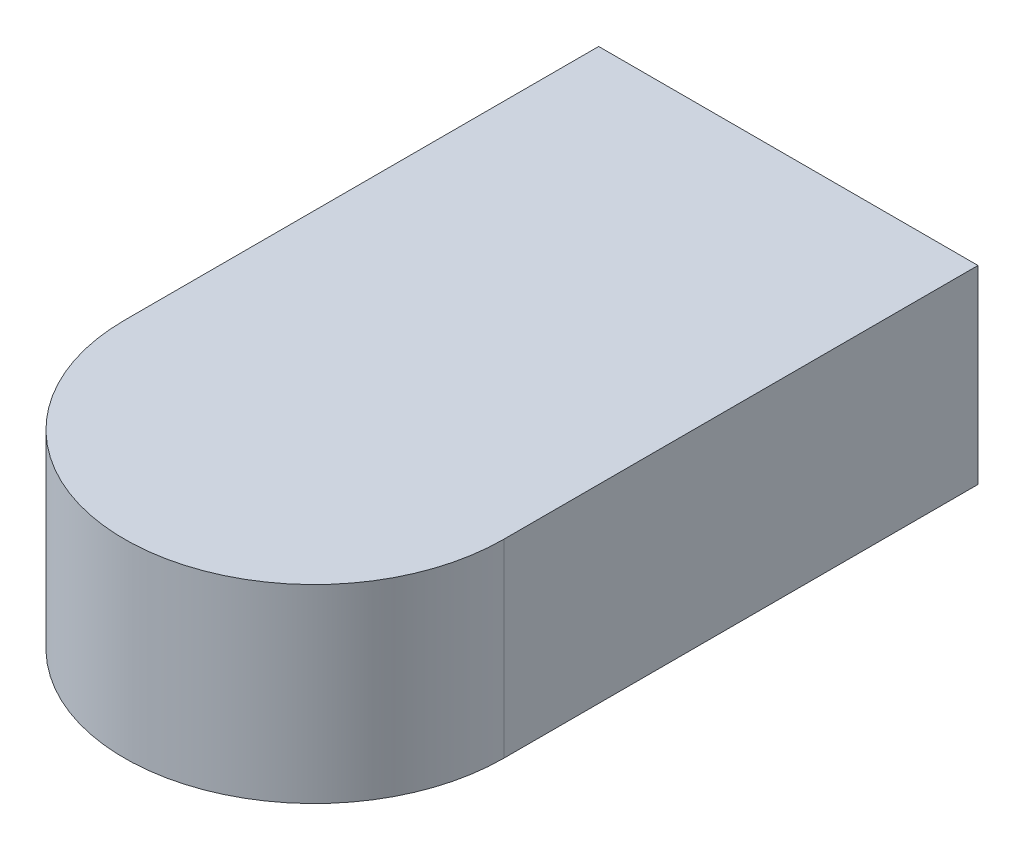
ISO-10303-21;
HEADER;
FILE_DESCRIPTION(('STEP AP214'),'2;1');
FILE_NAME('part.step','',(''),(''),'','','');
FILE_SCHEMA(('AUTOMOTIVE_DESIGN { 1 0 10303 214 1 1 1 1 }'));
ENDSEC;
DATA;
#1=APPLICATION_CONTEXT('core data for automotive mechanical design processes');
#2=APPLICATION_PROTOCOL_DEFINITION('international standard','automotive_design',2000,#1);
#3=PRODUCT_CONTEXT('',#1,'mechanical');
#4=PRODUCT('Part','Part','',(#3));
#5=PRODUCT_RELATED_PRODUCT_CATEGORY('part','',(#4));
#6=PRODUCT_DEFINITION_FORMATION('','',#4);
#7=PRODUCT_DEFINITION_CONTEXT('part definition',#1,'design');
#8=PRODUCT_DEFINITION('design','',#6,#7);
#9=PRODUCT_DEFINITION_SHAPE('','',#8);
#10=(LENGTH_UNIT() NAMED_UNIT(*) SI_UNIT(.MILLI.,.METRE.));
#11=(NAMED_UNIT(*) PLANE_ANGLE_UNIT() SI_UNIT($,.RADIAN.));
#12=(NAMED_UNIT(*) SI_UNIT($,.STERADIAN.) SOLID_ANGLE_UNIT());
#13=UNCERTAINTY_MEASURE_WITH_UNIT(LENGTH_MEASURE(1.E-05),#10,'distance_accuracy_value','');
#14=(GEOMETRIC_REPRESENTATION_CONTEXT(3) GLOBAL_UNCERTAINTY_ASSIGNED_CONTEXT((#13)) GLOBAL_UNIT_ASSIGNED_CONTEXT((#10,
#11,#12)) REPRESENTATION_CONTEXT('',''));
#15=CARTESIAN_POINT('',(0.,0.,0.));
#16=DIRECTION('',(0.,0.,1.));
#17=DIRECTION('',(1.,0.,0.));
#18=AXIS2_PLACEMENT_3D('',#15,#16,#17);
#19=CARTESIAN_POINT('',(-9.99999999999998,289.999999999999,20.0000000000005));
#20=DIRECTION('',(0.999999999999987,0.,0.));
#21=DIRECTION('',(0.,0.,-0.999999999999992));
#22=AXIS2_PLACEMENT_3D('',#19,#20,#21);
#23=PLANE('',#22);
#24=DIRECTION('',(0.,0.,0.999999999999992));
#25=VECTOR('',#24,1.);
#26=CARTESIAN_POINT('',(-9.99999999999976,279.999999999999,20.0000000000002));
#27=LINE('',#26,#25);
#28=CARTESIAN_POINT('',(-9.99999999999976,279.999999999999,20.0000000000002));
#29=VERTEX_POINT('',#28);
#30=CARTESIAN_POINT('',(-9.99999999999841,279.999999999999,45.0000000000008));
#31=VERTEX_POINT('',#30);
#32=EDGE_CURVE('E108',#29,#31,#27,.T.);
#33=ORIENTED_EDGE('',*,*,#32,.T.);
#34=DIRECTION('',(0.,-1.,0.));
#35=VECTOR('',#34,1.);
#36=CARTESIAN_POINT('',(-10.0000000000011,289.999999999999,44.9999999999995));
#37=LINE('',#36,#35);
#38=CARTESIAN_POINT('',(-10.0000000000011,289.999999999999,44.9999999999995));
#39=VERTEX_POINT('',#38);
#40=EDGE_CURVE('E11',#39,#31,#37,.T.);
#41=ORIENTED_EDGE('',*,*,#40,.F.);
#42=DIRECTION('',(0.,0.,0.999999999999992));
#43=VECTOR('',#42,1.);
#44=CARTESIAN_POINT('',(-9.99999999999998,289.999999999999,20.0000000000005));
#45=LINE('',#44,#43);
#46=CARTESIAN_POINT('',(-9.99999999999998,289.999999999999,20.0000000000005));
#47=VERTEX_POINT('',#46);
#48=EDGE_CURVE('E91',#47,#39,#45,.T.);
#49=ORIENTED_EDGE('',*,*,#48,.F.);
#50=DIRECTION('',(0.,-1.,0.));
#51=VECTOR('',#50,1.);
#52=CARTESIAN_POINT('',(-9.99999999999998,289.999999999999,20.0000000000005));
#53=LINE('',#52,#51);
#54=EDGE_CURVE('E104',#47,#29,#53,.T.);
#55=ORIENTED_EDGE('',*,*,#54,.T.);
#56=EDGE_LOOP('',(#33,#41,#49,#55));
#57=FACE_BOUND('',#56,.T.);
#58=ADVANCED_FACE('F39',(#57),#23,.F.);
#59=CARTESIAN_POINT('',(4.44089209850063E-13,289.999999999999,44.9999999999992));
#60=DIRECTION('',(0.,-1.,0.));
#61=DIRECTION('',(0.,0.,-0.999999999999992));
#62=AXIS2_PLACEMENT_3D('',#59,#60,#61);
#63=CYLINDRICAL_SURFACE('',#62,10.);
#64=CARTESIAN_POINT('',(4.4408939513852E-13,279.999999999999,44.9999999999992));
#65=DIRECTION('',(0.,1.,0.));
#66=DIRECTION('',(0.,0.,-0.999999999999992));
#67=AXIS2_PLACEMENT_3D('',#64,#65,#66);
#68=CIRCLE('',#67,10.);
#69=CARTESIAN_POINT('',(10.0000000000003,279.999999999999,44.9999999999998));
#70=VERTEX_POINT('',#69);
#71=EDGE_CURVE('E96',#31,#70,#68,.T.);
#72=ORIENTED_EDGE('',*,*,#71,.T.);
#73=DIRECTION('',(0.,-1.,0.));
#74=VECTOR('',#73,1.);
#75=CARTESIAN_POINT('',(10.0000000000012,289.999999999999,45.0000000000013));
#76=LINE('',#75,#74);
#77=CARTESIAN_POINT('',(10.0000000000012,289.999999999999,45.0000000000013));
#78=VERTEX_POINT('',#77);
#79=EDGE_CURVE('E48',#78,#70,#76,.T.);
#80=ORIENTED_EDGE('',*,*,#79,.F.);
#81=CARTESIAN_POINT('',(4.44089209850063E-13,289.999999999999,44.9999999999992));
#82=DIRECTION('',(0.,1.,0.));
#83=DIRECTION('',(0.,0.,-0.999999999999992));
#84=AXIS2_PLACEMENT_3D('',#81,#82,#83);
#85=CIRCLE('',#84,10.);
#86=EDGE_CURVE('E86',#39,#78,#85,.T.);
#87=ORIENTED_EDGE('',*,*,#86,.F.);
#88=ORIENTED_EDGE('',*,*,#40,.T.);
#89=EDGE_LOOP('',(#72,#80,#87,#88));
#90=FACE_BOUND('',#89,.T.);
#91=ADVANCED_FACE('F95',(#90),#63,.T.);
#92=CARTESIAN_POINT('',(9.99999999999937,290.,19.9999999999989));
#93=DIRECTION('',(-0.999999999999987,0.,0.));
#94=DIRECTION('',(0.,0.,0.999999999999992));
#95=AXIS2_PLACEMENT_3D('',#92,#93,#94);
#96=PLANE('',#95);
#97=DIRECTION('',(0.,0.,-0.999999999999992));
#98=VECTOR('',#97,1.);
#99=CARTESIAN_POINT('',(9.99999999999981,280.,19.9999999999995));
#100=LINE('',#99,#98);
#101=CARTESIAN_POINT('',(9.99999999999981,280.,19.9999999999995));
#102=VERTEX_POINT('',#101);
#103=EDGE_CURVE('E73',#70,#102,#100,.T.);
#104=ORIENTED_EDGE('',*,*,#103,.T.);
#105=DIRECTION('',(0.,-1.,0.));
#106=VECTOR('',#105,1.);
#107=CARTESIAN_POINT('',(9.99999999999937,290.,19.9999999999989));
#108=LINE('',#107,#106);
#109=CARTESIAN_POINT('',(9.99999999999937,290.,19.9999999999989));
#110=VERTEX_POINT('',#109);
#111=EDGE_CURVE('E98',#110,#102,#108,.T.);
#112=ORIENTED_EDGE('',*,*,#111,.F.);
#113=DIRECTION('',(0.,0.,-0.999999999999992));
#114=VECTOR('',#113,1.);
#115=CARTESIAN_POINT('',(9.99999999999937,290.,19.9999999999989));
#116=LINE('',#115,#114);
#117=EDGE_CURVE('E89',#78,#110,#116,.T.);
#118=ORIENTED_EDGE('',*,*,#117,.F.);
#119=ORIENTED_EDGE('',*,*,#79,.T.);
#120=EDGE_LOOP('',(#104,#112,#118,#119));
#121=FACE_BOUND('',#120,.T.);
#122=ADVANCED_FACE('F99',(#121),#96,.F.);
#123=CARTESIAN_POINT('',(-9.99999999999998,289.999999999999,20.0000000000005));
#124=DIRECTION('',(0.,0.,0.999999999999992));
#125=DIRECTION('',(0.999999999999987,0.,0.));
#126=AXIS2_PLACEMENT_3D('',#123,#124,#125);
#127=PLANE('',#126);
#128=DIRECTION('',(-0.999999999999987,0.,0.));
#129=VECTOR('',#128,1.);
#130=CARTESIAN_POINT('',(-9.99999999999976,279.999999999999,20.0000000000002));
#131=LINE('',#130,#129);
#132=EDGE_CURVE('E79',#102,#29,#131,.T.);
#133=ORIENTED_EDGE('',*,*,#132,.T.);
#134=ORIENTED_EDGE('',*,*,#54,.F.);
#135=DIRECTION('',(-0.999999999999987,0.,0.));
#136=VECTOR('',#135,1.);
#137=CARTESIAN_POINT('',(-9.99999999999998,289.999999999999,20.0000000000005));
#138=LINE('',#137,#136);
#139=EDGE_CURVE('E56',#110,#47,#138,.T.);
#140=ORIENTED_EDGE('',*,*,#139,.F.);
#141=ORIENTED_EDGE('',*,*,#111,.T.);
#142=EDGE_LOOP('',(#133,#134,#140,#141));
#143=FACE_BOUND('',#142,.T.);
#144=ADVANCED_FACE('F122',(#143),#127,.F.);
#145=CARTESIAN_POINT('',(4.44089209850063E-13,289.999999999999,44.9999999999992));
#146=DIRECTION('',(0.,-1.,0.));
#147=DIRECTION('',(0.,0.,-0.999999999999992));
#148=AXIS2_PLACEMENT_3D('',#145,#146,#147);
#149=PLANE('',#148);
#150=ORIENTED_EDGE('',*,*,#48,.T.);
#151=ORIENTED_EDGE('',*,*,#86,.T.);
#152=ORIENTED_EDGE('',*,*,#117,.T.);
#153=ORIENTED_EDGE('',*,*,#139,.T.);
#154=EDGE_LOOP('',(#150,#151,#152,#153));
#155=FACE_BOUND('',#154,.T.);
#156=ADVANCED_FACE('F87',(#155),#149,.F.);
#157=CARTESIAN_POINT('',(4.4408939513852E-13,279.999999999999,44.9999999999992));
#158=DIRECTION('',(0.,-1.,0.));
#159=DIRECTION('',(0.,0.,-0.999999999999992));
#160=AXIS2_PLACEMENT_3D('',#157,#158,#159);
#161=PLANE('',#160);
#162=ORIENTED_EDGE('',*,*,#32,.F.);
#163=ORIENTED_EDGE('',*,*,#132,.F.);
#164=ORIENTED_EDGE('',*,*,#103,.F.);
#165=ORIENTED_EDGE('',*,*,#71,.F.);
#166=EDGE_LOOP('',(#162,#163,#164,#165));
#167=FACE_BOUND('',#166,.T.);
#168=ADVANCED_FACE('F125',(#167),#161,.T.);
#169=CLOSED_SHELL('',(#58,#91,#122,#144,#156,#168));
#170=MANIFOLD_SOLID_BREP('B2',#169);
#171=ADVANCED_BREP_SHAPE_REPRESENTATION('',(#18,#170),#14);
#172=SHAPE_DEFINITION_REPRESENTATION(#9,#171);
ENDSEC;
END-ISO-10303-21;
